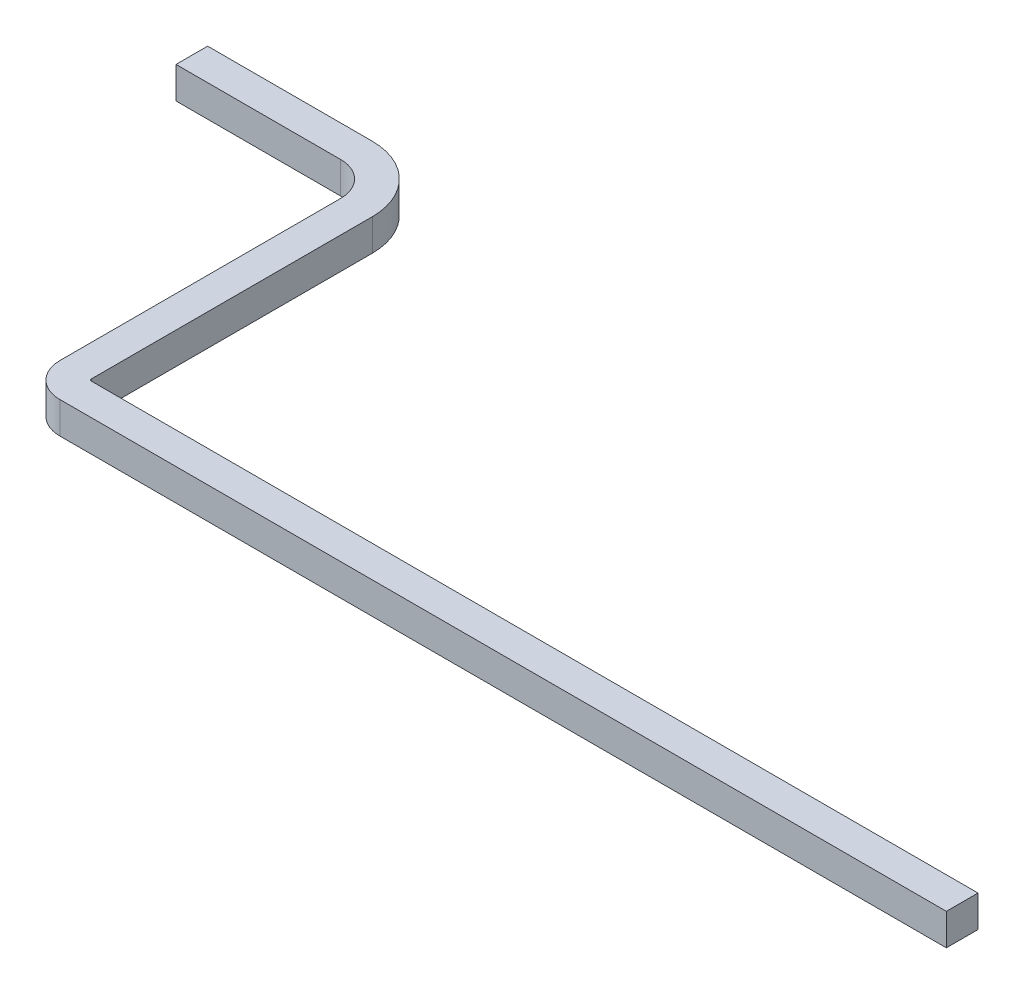
ISO-10303-21;
HEADER;
FILE_DESCRIPTION(('STEP AP214'),'2;1');
FILE_NAME('part.step','',(''),(''),'','','');
FILE_SCHEMA(('AUTOMOTIVE_DESIGN { 1 0 10303 214 1 1 1 1 }'));
ENDSEC;
DATA;
#1=APPLICATION_CONTEXT('core data for automotive mechanical design processes');
#2=APPLICATION_PROTOCOL_DEFINITION('international standard','automotive_design',2000,#1);
#3=PRODUCT_CONTEXT('',#1,'mechanical');
#4=PRODUCT('Part','Part','',(#3));
#5=PRODUCT_RELATED_PRODUCT_CATEGORY('part','',(#4));
#6=PRODUCT_DEFINITION_FORMATION('','',#4);
#7=PRODUCT_DEFINITION_CONTEXT('part definition',#1,'design');
#8=PRODUCT_DEFINITION('design','',#6,#7);
#9=PRODUCT_DEFINITION_SHAPE('','',#8);
#10=(LENGTH_UNIT() NAMED_UNIT(*) SI_UNIT(.MILLI.,.METRE.));
#11=(NAMED_UNIT(*) PLANE_ANGLE_UNIT() SI_UNIT($,.RADIAN.));
#12=(NAMED_UNIT(*) SI_UNIT($,.STERADIAN.) SOLID_ANGLE_UNIT());
#13=UNCERTAINTY_MEASURE_WITH_UNIT(LENGTH_MEASURE(1.E-05),#10,'distance_accuracy_value','');
#14=(GEOMETRIC_REPRESENTATION_CONTEXT(3) GLOBAL_UNCERTAINTY_ASSIGNED_CONTEXT((#13)) GLOBAL_UNIT_ASSIGNED_CONTEXT((#10,
#11,#12)) REPRESENTATION_CONTEXT('',''));
#15=CARTESIAN_POINT('',(0.,0.,0.));
#16=DIRECTION('',(0.,0.,1.));
#17=DIRECTION('',(1.,0.,0.));
#18=AXIS2_PLACEMENT_3D('',#15,#16,#17);
#19=CARTESIAN_POINT('',(-2.26,0.075,-0.16));
#20=DIRECTION('',(-1.,0.,0.));
#21=DIRECTION('',(0.,0.,1.));
#22=AXIS2_PLACEMENT_3D('',#19,#20,#21);
#23=PLANE('',#22);
#24=DIRECTION('',(0.,0.,-1.));
#25=VECTOR('',#24,1.);
#26=CARTESIAN_POINT('',(-2.26,-0.075,-0.16));
#27=LINE('',#26,#25);
#28=CARTESIAN_POINT('',(-2.26,-0.075,-0.16));
#29=VERTEX_POINT('',#28);
#30=CARTESIAN_POINT('',(-2.26,-0.075,-1.49));
#31=VERTEX_POINT('',#30);
#32=EDGE_CURVE('E179',#29,#31,#27,.T.);
#33=ORIENTED_EDGE('',*,*,#32,.F.);
#34=DIRECTION('',(0.,-1.,0.));
#35=VECTOR('',#34,1.);
#36=CARTESIAN_POINT('',(-2.26,0.075,-0.16));
#37=LINE('',#36,#35);
#38=CARTESIAN_POINT('',(-2.26,0.075,-0.16));
#39=VERTEX_POINT('',#38);
#40=EDGE_CURVE('E155',#39,#29,#37,.T.);
#41=ORIENTED_EDGE('',*,*,#40,.F.);
#42=DIRECTION('',(0.,0.,-1.));
#43=VECTOR('',#42,1.);
#44=CARTESIAN_POINT('',(-2.26,0.075,-0.16));
#45=LINE('',#44,#43);
#46=CARTESIAN_POINT('',(-2.26,0.075,-1.49));
#47=VERTEX_POINT('',#46);
#48=EDGE_CURVE('E208',#39,#47,#45,.T.);
#49=ORIENTED_EDGE('',*,*,#48,.T.);
#50=DIRECTION('',(0.,-1.,0.));
#51=VECTOR('',#50,1.);
#52=CARTESIAN_POINT('',(-2.26,0.075,-1.49));
#53=LINE('',#52,#51);
#54=EDGE_CURVE('E11',#47,#31,#53,.T.);
#55=ORIENTED_EDGE('',*,*,#54,.T.);
#56=EDGE_LOOP('',(#33,#41,#49,#55));
#57=FACE_BOUND('',#56,.T.);
#58=ADVANCED_FACE('F16',(#57),#23,.T.);
#59=CARTESIAN_POINT('',(-2.42,0.075,-1.49));
#60=DIRECTION('',(0.,1.,0.));
#61=DIRECTION('',(0.,0.,-1.));
#62=AXIS2_PLACEMENT_3D('',#59,#60,#61);
#63=CYLINDRICAL_SURFACE('',#62,0.16);
#64=CARTESIAN_POINT('',(-2.42,-0.075,-1.49));
#65=DIRECTION('',(0.,1.,0.));
#66=DIRECTION('',(1.,0.,0.));
#67=AXIS2_PLACEMENT_3D('',#64,#65,#66);
#68=CIRCLE('',#67,0.16);
#69=CARTESIAN_POINT('',(-2.42,-0.075,-1.65));
#70=VERTEX_POINT('',#69);
#71=EDGE_CURVE('E199',#31,#70,#68,.T.);
#72=ORIENTED_EDGE('',*,*,#71,.F.);
#73=ORIENTED_EDGE('',*,*,#54,.F.);
#74=CARTESIAN_POINT('',(-2.42,0.075,-1.49));
#75=DIRECTION('',(0.,1.,0.));
#76=DIRECTION('',(1.,0.,0.));
#77=AXIS2_PLACEMENT_3D('',#74,#75,#76);
#78=CIRCLE('',#77,0.16);
#79=CARTESIAN_POINT('',(-2.42,0.075,-1.65));
#80=VERTEX_POINT('',#79);
#81=EDGE_CURVE('E202',#47,#80,#78,.T.);
#82=ORIENTED_EDGE('',*,*,#81,.T.);
#83=DIRECTION('',(0.,-1.,0.));
#84=VECTOR('',#83,1.);
#85=CARTESIAN_POINT('',(-2.42,0.075,-1.65));
#86=LINE('',#85,#84);
#87=EDGE_CURVE('E27',#80,#70,#86,.T.);
#88=ORIENTED_EDGE('',*,*,#87,.T.);
#89=EDGE_LOOP('',(#72,#73,#82,#88));
#90=FACE_BOUND('',#89,.T.);
#91=ADVANCED_FACE('F420',(#90),#63,.F.);
#92=CARTESIAN_POINT('',(-2.42,0.075,-1.65));
#93=DIRECTION('',(0.,0.,1.));
#94=DIRECTION('',(1.,0.,0.));
#95=AXIS2_PLACEMENT_3D('',#92,#93,#94);
#96=PLANE('',#95);
#97=DIRECTION('',(-1.,0.,0.));
#98=VECTOR('',#97,1.);
#99=CARTESIAN_POINT('',(-2.42,-0.075,-1.65));
#100=LINE('',#99,#98);
#101=CARTESIAN_POINT('',(-3.2,-0.075,-1.65));
#102=VERTEX_POINT('',#101);
#103=EDGE_CURVE('E196',#70,#102,#100,.T.);
#104=ORIENTED_EDGE('',*,*,#103,.F.);
#105=ORIENTED_EDGE('',*,*,#87,.F.);
#106=DIRECTION('',(-1.,0.,0.));
#107=VECTOR('',#106,1.);
#108=CARTESIAN_POINT('',(-2.42,0.075,-1.65));
#109=LINE('',#108,#107);
#110=CARTESIAN_POINT('',(-3.2,0.075,-1.65));
#111=VERTEX_POINT('',#110);
#112=EDGE_CURVE('E147',#80,#111,#109,.T.);
#113=ORIENTED_EDGE('',*,*,#112,.T.);
#114=DIRECTION('',(0.,-1.,0.));
#115=VECTOR('',#114,1.);
#116=CARTESIAN_POINT('',(-3.2,0.075,-1.65));
#117=LINE('',#116,#115);
#118=EDGE_CURVE('E175',#111,#102,#117,.T.);
#119=ORIENTED_EDGE('',*,*,#118,.T.);
#120=EDGE_LOOP('',(#104,#105,#113,#119));
#121=FACE_BOUND('',#120,.T.);
#122=ADVANCED_FACE('F419',(#121),#96,.T.);
#123=CARTESIAN_POINT('',(2.1,0.075,-0.15));
#124=DIRECTION('',(0.,0.,1.));
#125=DIRECTION('',(1.,0.,0.));
#126=AXIS2_PLACEMENT_3D('',#123,#124,#125);
#127=PLANE('',#126);
#128=DIRECTION('',(-1.,0.,0.));
#129=VECTOR('',#128,1.);
#130=CARTESIAN_POINT('',(2.1,-0.075,-0.15));
#131=LINE('',#130,#129);
#132=CARTESIAN_POINT('',(2.1,-0.075,-0.15));
#133=VERTEX_POINT('',#132);
#134=CARTESIAN_POINT('',(-2.1,-0.075,-0.15));
#135=VERTEX_POINT('',#134);
#136=EDGE_CURVE('E126',#133,#135,#131,.T.);
#137=ORIENTED_EDGE('',*,*,#136,.T.);
#138=DIRECTION('',(0.,-1.,0.));
#139=VECTOR('',#138,1.);
#140=CARTESIAN_POINT('',(-2.1,0.075,-0.15));
#141=LINE('',#140,#139);
#142=CARTESIAN_POINT('',(-2.1,0.075,-0.15));
#143=VERTEX_POINT('',#142);
#144=EDGE_CURVE('E41',#143,#135,#141,.T.);
#145=ORIENTED_EDGE('',*,*,#144,.F.);
#146=DIRECTION('',(-1.,0.,0.));
#147=VECTOR('',#146,1.);
#148=CARTESIAN_POINT('',(2.1,0.075,-0.15));
#149=LINE('',#148,#147);
#150=CARTESIAN_POINT('',(2.1,0.075,-0.15));
#151=VERTEX_POINT('',#150);
#152=EDGE_CURVE('E152',#151,#143,#149,.T.);
#153=ORIENTED_EDGE('',*,*,#152,.F.);
#154=DIRECTION('',(0.,-1.,0.));
#155=VECTOR('',#154,1.);
#156=CARTESIAN_POINT('',(2.1,0.075,-0.15));
#157=LINE('',#156,#155);
#158=EDGE_CURVE('E142',#151,#133,#157,.T.);
#159=ORIENTED_EDGE('',*,*,#158,.T.);
#160=EDGE_LOOP('',(#137,#145,#153,#159));
#161=FACE_BOUND('',#160,.T.);
#162=ADVANCED_FACE('F150',(#161),#127,.F.);
#163=CARTESIAN_POINT('',(-2.1,0.075,-0.16));
#164=DIRECTION('',(0.,1.,0.));
#165=DIRECTION('',(0.,0.,-1.));
#166=AXIS2_PLACEMENT_3D('',#163,#164,#165);
#167=CYLINDRICAL_SURFACE('',#166,0.01);
#168=CARTESIAN_POINT('',(-2.1,-0.075,-0.16));
#169=DIRECTION('',(0.,-1.,0.));
#170=DIRECTION('',(0.,0.,-1.));
#171=AXIS2_PLACEMENT_3D('',#168,#169,#170);
#172=CIRCLE('',#171,0.01);
#173=CARTESIAN_POINT('',(-2.11,-0.075,-0.16));
#174=VERTEX_POINT('',#173);
#175=EDGE_CURVE('E134',#135,#174,#172,.T.);
#176=ORIENTED_EDGE('',*,*,#175,.T.);
#177=DIRECTION('',(0.,-1.,0.));
#178=VECTOR('',#177,1.);
#179=CARTESIAN_POINT('',(-2.11,0.075,-0.16));
#180=LINE('',#179,#178);
#181=CARTESIAN_POINT('',(-2.11,0.075,-0.16));
#182=VERTEX_POINT('',#181);
#183=EDGE_CURVE('E182',#182,#174,#180,.T.);
#184=ORIENTED_EDGE('',*,*,#183,.F.);
#185=CARTESIAN_POINT('',(-2.1,0.075,-0.16));
#186=DIRECTION('',(0.,-1.,0.));
#187=DIRECTION('',(0.,0.,-1.));
#188=AXIS2_PLACEMENT_3D('',#185,#186,#187);
#189=CIRCLE('',#188,0.01);
#190=EDGE_CURVE('E173',#143,#182,#189,.T.);
#191=ORIENTED_EDGE('',*,*,#190,.F.);
#192=ORIENTED_EDGE('',*,*,#144,.T.);
#193=EDGE_LOOP('',(#176,#184,#191,#192));
#194=FACE_BOUND('',#193,.T.);
#195=ADVANCED_FACE('F405',(#194),#167,.F.);
#196=CARTESIAN_POINT('',(-2.11,0.075,-0.16));
#197=DIRECTION('',(-1.,0.,0.));
#198=DIRECTION('',(0.,0.,1.));
#199=AXIS2_PLACEMENT_3D('',#196,#197,#198);
#200=PLANE('',#199);
#201=DIRECTION('',(0.,0.,-1.));
#202=VECTOR('',#201,1.);
#203=CARTESIAN_POINT('',(-2.11,-0.075,-0.16));
#204=LINE('',#203,#202);
#205=CARTESIAN_POINT('',(-2.11,-0.075,-1.49));
#206=VERTEX_POINT('',#205);
#207=EDGE_CURVE('E235',#174,#206,#204,.T.);
#208=ORIENTED_EDGE('',*,*,#207,.T.);
#209=DIRECTION('',(0.,-1.,0.));
#210=VECTOR('',#209,1.);
#211=CARTESIAN_POINT('',(-2.11,0.075,-1.49));
#212=LINE('',#211,#210);
#213=CARTESIAN_POINT('',(-2.11,0.075,-1.49));
#214=VERTEX_POINT('',#213);
#215=EDGE_CURVE('E249',#214,#206,#212,.T.);
#216=ORIENTED_EDGE('',*,*,#215,.F.);
#217=DIRECTION('',(0.,0.,-1.));
#218=VECTOR('',#217,1.);
#219=CARTESIAN_POINT('',(-2.11,0.075,-0.16));
#220=LINE('',#219,#218);
#221=EDGE_CURVE('E169',#182,#214,#220,.T.);
#222=ORIENTED_EDGE('',*,*,#221,.F.);
#223=ORIENTED_EDGE('',*,*,#183,.T.);
#224=EDGE_LOOP('',(#208,#216,#222,#223));
#225=FACE_BOUND('',#224,.T.);
#226=ADVANCED_FACE('F18',(#225),#200,.F.);
#227=CARTESIAN_POINT('',(-2.42,0.075,-1.49));
#228=DIRECTION('',(0.,1.,0.));
#229=DIRECTION('',(0.,0.,-1.));
#230=AXIS2_PLACEMENT_3D('',#227,#228,#229);
#231=CYLINDRICAL_SURFACE('',#230,0.31);
#232=CARTESIAN_POINT('',(-2.42,-0.075,-1.49));
#233=DIRECTION('',(0.,1.,0.));
#234=DIRECTION('',(0.,0.,-1.));
#235=AXIS2_PLACEMENT_3D('',#232,#233,#234);
#236=CIRCLE('',#235,0.31);
#237=CARTESIAN_POINT('',(-2.42,-0.075,-1.8));
#238=VERTEX_POINT('',#237);
#239=EDGE_CURVE('E239',#206,#238,#236,.T.);
#240=ORIENTED_EDGE('',*,*,#239,.T.);
#241=DIRECTION('',(0.,-1.,0.));
#242=VECTOR('',#241,1.);
#243=CARTESIAN_POINT('',(-2.42,0.075,-1.8));
#244=LINE('',#243,#242);
#245=CARTESIAN_POINT('',(-2.42,0.075,-1.8));
#246=VERTEX_POINT('',#245);
#247=EDGE_CURVE('E115',#246,#238,#244,.T.);
#248=ORIENTED_EDGE('',*,*,#247,.F.);
#249=CARTESIAN_POINT('',(-2.42,0.075,-1.49));
#250=DIRECTION('',(0.,1.,0.));
#251=DIRECTION('',(0.,0.,-1.));
#252=AXIS2_PLACEMENT_3D('',#249,#250,#251);
#253=CIRCLE('',#252,0.31);
#254=EDGE_CURVE('E172',#214,#246,#253,.T.);
#255=ORIENTED_EDGE('',*,*,#254,.F.);
#256=ORIENTED_EDGE('',*,*,#215,.T.);
#257=EDGE_LOOP('',(#240,#248,#255,#256));
#258=FACE_BOUND('',#257,.T.);
#259=ADVANCED_FACE('F272',(#258),#231,.T.);
#260=CARTESIAN_POINT('',(-2.42,0.075,-1.8));
#261=DIRECTION('',(0.,0.,1.));
#262=DIRECTION('',(1.,0.,0.));
#263=AXIS2_PLACEMENT_3D('',#260,#261,#262);
#264=PLANE('',#263);
#265=DIRECTION('',(-1.,0.,0.));
#266=VECTOR('',#265,1.);
#267=CARTESIAN_POINT('',(-2.42,-0.075,-1.8));
#268=LINE('',#267,#266);
#269=CARTESIAN_POINT('',(-3.2,-0.075,-1.8));
#270=VERTEX_POINT('',#269);
#271=EDGE_CURVE('E198',#238,#270,#268,.T.);
#272=ORIENTED_EDGE('',*,*,#271,.T.);
#273=DIRECTION('',(0.,-1.,0.));
#274=VECTOR('',#273,1.);
#275=CARTESIAN_POINT('',(-3.2,0.075,-1.8));
#276=LINE('',#275,#274);
#277=CARTESIAN_POINT('',(-3.2,0.075,-1.8));
#278=VERTEX_POINT('',#277);
#279=EDGE_CURVE('E220',#278,#270,#276,.T.);
#280=ORIENTED_EDGE('',*,*,#279,.F.);
#281=DIRECTION('',(-1.,0.,0.));
#282=VECTOR('',#281,1.);
#283=CARTESIAN_POINT('',(-2.42,0.075,-1.8));
#284=LINE('',#283,#282);
#285=EDGE_CURVE('E192',#246,#278,#284,.T.);
#286=ORIENTED_EDGE('',*,*,#285,.F.);
#287=ORIENTED_EDGE('',*,*,#247,.T.);
#288=EDGE_LOOP('',(#272,#280,#286,#287));
#289=FACE_BOUND('',#288,.T.);
#290=ADVANCED_FACE('F279',(#289),#264,.F.);
#291=CARTESIAN_POINT('',(2.1,-0.075,0.));
#292=DIRECTION('',(0.,1.,0.));
#293=DIRECTION('',(1.,0.,0.));
#294=AXIS2_PLACEMENT_3D('',#291,#292,#293);
#295=PLANE('',#294);
#296=DIRECTION('',(-1.,0.,0.));
#297=VECTOR('',#296,1.);
#298=CARTESIAN_POINT('',(2.1,-0.075,0.));
#299=LINE('',#298,#297);
#300=CARTESIAN_POINT('',(2.1,-0.075,0.));
#301=VERTEX_POINT('',#300);
#302=CARTESIAN_POINT('',(-2.1,-0.075,0.));
#303=VERTEX_POINT('',#302);
#304=EDGE_CURVE('E20',#301,#303,#299,.T.);
#305=ORIENTED_EDGE('',*,*,#304,.T.);
#306=CARTESIAN_POINT('',(-2.1,-0.075,-0.16));
#307=DIRECTION('',(0.,-1.,0.));
#308=DIRECTION('',(1.,0.,0.));
#309=AXIS2_PLACEMENT_3D('',#306,#307,#308);
#310=CIRCLE('',#309,0.16);
#311=EDGE_CURVE('E184',#303,#29,#310,.T.);
#312=ORIENTED_EDGE('',*,*,#311,.T.);
#313=ORIENTED_EDGE('',*,*,#32,.T.);
#314=ORIENTED_EDGE('',*,*,#71,.T.);
#315=ORIENTED_EDGE('',*,*,#103,.T.);
#316=DIRECTION('',(0.,0.,1.));
#317=VECTOR('',#316,1.);
#318=CARTESIAN_POINT('',(-3.2,-0.075,-1.65));
#319=LINE('',#318,#317);
#320=EDGE_CURVE('E180',#270,#102,#319,.T.);
#321=ORIENTED_EDGE('',*,*,#320,.F.);
#322=ORIENTED_EDGE('',*,*,#271,.F.);
#323=ORIENTED_EDGE('',*,*,#239,.F.);
#324=ORIENTED_EDGE('',*,*,#207,.F.);
#325=ORIENTED_EDGE('',*,*,#175,.F.);
#326=ORIENTED_EDGE('',*,*,#136,.F.);
#327=DIRECTION('',(0.,0.,1.));
#328=VECTOR('',#327,1.);
#329=CARTESIAN_POINT('',(2.1,-0.075,0.));
#330=LINE('',#329,#328);
#331=EDGE_CURVE('E131',#133,#301,#330,.T.);
#332=ORIENTED_EDGE('',*,*,#331,.T.);
#333=EDGE_LOOP('',(#305,#312,#313,#314,#315,#321,#322,#323,#324,#325,#326,#332));
#334=FACE_BOUND('',#333,.T.);
#335=ADVANCED_FACE('F129',(#334),#295,.F.);
#336=CARTESIAN_POINT('',(-3.2,0.075,-1.65));
#337=DIRECTION('',(-1.,0.,0.));
#338=DIRECTION('',(0.,0.,1.));
#339=AXIS2_PLACEMENT_3D('',#336,#337,#338);
#340=PLANE('',#339);
#341=DIRECTION('',(0.,0.,1.));
#342=VECTOR('',#341,1.);
#343=CARTESIAN_POINT('',(-3.2,0.075,-1.65));
#344=LINE('',#343,#342);
#345=EDGE_CURVE('E224',#278,#111,#344,.T.);
#346=ORIENTED_EDGE('',*,*,#345,.F.);
#347=ORIENTED_EDGE('',*,*,#279,.T.);
#348=ORIENTED_EDGE('',*,*,#320,.T.);
#349=ORIENTED_EDGE('',*,*,#118,.F.);
#350=EDGE_LOOP('',(#346,#347,#348,#349));
#351=FACE_BOUND('',#350,.T.);
#352=ADVANCED_FACE('F418',(#351),#340,.T.);
#353=CARTESIAN_POINT('',(-2.42,0.075,-1.65));
#354=DIRECTION('',(0.,1.,0.));
#355=DIRECTION('',(1.,0.,0.));
#356=AXIS2_PLACEMENT_3D('',#353,#354,#355);
#357=PLANE('',#356);
#358=ORIENTED_EDGE('',*,*,#112,.F.);
#359=ORIENTED_EDGE('',*,*,#81,.F.);
#360=ORIENTED_EDGE('',*,*,#48,.F.);
#361=CARTESIAN_POINT('',(-2.1,0.075,-0.16));
#362=DIRECTION('',(0.,-1.,0.));
#363=DIRECTION('',(1.,0.,0.));
#364=AXIS2_PLACEMENT_3D('',#361,#362,#363);
#365=CIRCLE('',#364,0.16);
#366=CARTESIAN_POINT('',(-2.1,0.075,0.));
#367=VERTEX_POINT('',#366);
#368=EDGE_CURVE('E164',#367,#39,#365,.T.);
#369=ORIENTED_EDGE('',*,*,#368,.F.);
#370=DIRECTION('',(-1.,0.,0.));
#371=VECTOR('',#370,1.);
#372=CARTESIAN_POINT('',(2.1,0.075,0.));
#373=LINE('',#372,#371);
#374=CARTESIAN_POINT('',(2.1,0.075,0.));
#375=VERTEX_POINT('',#374);
#376=EDGE_CURVE('E231',#375,#367,#373,.T.);
#377=ORIENTED_EDGE('',*,*,#376,.F.);
#378=DIRECTION('',(0.,0.,1.));
#379=VECTOR('',#378,1.);
#380=CARTESIAN_POINT('',(2.1,0.075,0.));
#381=LINE('',#380,#379);
#382=EDGE_CURVE('E148',#151,#375,#381,.T.);
#383=ORIENTED_EDGE('',*,*,#382,.F.);
#384=ORIENTED_EDGE('',*,*,#152,.T.);
#385=ORIENTED_EDGE('',*,*,#190,.T.);
#386=ORIENTED_EDGE('',*,*,#221,.T.);
#387=ORIENTED_EDGE('',*,*,#254,.T.);
#388=ORIENTED_EDGE('',*,*,#285,.T.);
#389=ORIENTED_EDGE('',*,*,#345,.T.);
#390=EDGE_LOOP('',(#358,#359,#360,#369,#377,#383,#384,#385,#386,#387,#388,#389));
#391=FACE_BOUND('',#390,.T.);
#392=ADVANCED_FACE('F407',(#391),#357,.T.);
#393=CARTESIAN_POINT('',(2.1,0.075,0.));
#394=DIRECTION('',(-1.,0.,0.));
#395=DIRECTION('',(0.,0.,1.));
#396=AXIS2_PLACEMENT_3D('',#393,#394,#395);
#397=PLANE('',#396);
#398=ORIENTED_EDGE('',*,*,#158,.F.);
#399=ORIENTED_EDGE('',*,*,#382,.T.);
#400=DIRECTION('',(0.,-1.,0.));
#401=VECTOR('',#400,1.);
#402=CARTESIAN_POINT('',(2.1,0.075,0.));
#403=LINE('',#402,#401);
#404=EDGE_CURVE('E144',#375,#301,#403,.T.);
#405=ORIENTED_EDGE('',*,*,#404,.T.);
#406=ORIENTED_EDGE('',*,*,#331,.F.);
#407=EDGE_LOOP('',(#398,#399,#405,#406));
#408=FACE_BOUND('',#407,.T.);
#409=ADVANCED_FACE('F141',(#408),#397,.F.);
#410=CARTESIAN_POINT('',(-2.1,0.075,-0.16));
#411=DIRECTION('',(0.,1.,0.));
#412=DIRECTION('',(0.,0.,-1.));
#413=AXIS2_PLACEMENT_3D('',#410,#411,#412);
#414=CYLINDRICAL_SURFACE('',#413,0.16);
#415=ORIENTED_EDGE('',*,*,#311,.F.);
#416=DIRECTION('',(0.,-1.,0.));
#417=VECTOR('',#416,1.);
#418=CARTESIAN_POINT('',(-2.1,0.075,0.));
#419=LINE('',#418,#417);
#420=EDGE_CURVE('E188',#367,#303,#419,.T.);
#421=ORIENTED_EDGE('',*,*,#420,.F.);
#422=ORIENTED_EDGE('',*,*,#368,.T.);
#423=ORIENTED_EDGE('',*,*,#40,.T.);
#424=EDGE_LOOP('',(#415,#421,#422,#423));
#425=FACE_BOUND('',#424,.T.);
#426=ADVANCED_FACE('F296',(#425),#414,.T.);
#427=CARTESIAN_POINT('',(2.1,0.075,0.));
#428=DIRECTION('',(0.,0.,1.));
#429=DIRECTION('',(1.,0.,0.));
#430=AXIS2_PLACEMENT_3D('',#427,#428,#429);
#431=PLANE('',#430);
#432=ORIENTED_EDGE('',*,*,#304,.F.);
#433=ORIENTED_EDGE('',*,*,#404,.F.);
#434=ORIENTED_EDGE('',*,*,#376,.T.);
#435=ORIENTED_EDGE('',*,*,#420,.T.);
#436=EDGE_LOOP('',(#432,#433,#434,#435));
#437=FACE_BOUND('',#436,.T.);
#438=ADVANCED_FACE('F299',(#437),#431,.T.);
#439=CLOSED_SHELL('',(#58,#91,#122,#162,#195,#226,#259,#290,#335,#352,#392,#409,#426,#438));
#440=MANIFOLD_SOLID_BREP('B1',#439);
#441=ADVANCED_BREP_SHAPE_REPRESENTATION('',(#18,#440),#14);
#442=SHAPE_DEFINITION_REPRESENTATION(#9,#441);
ENDSEC;
END-ISO-10303-21;
